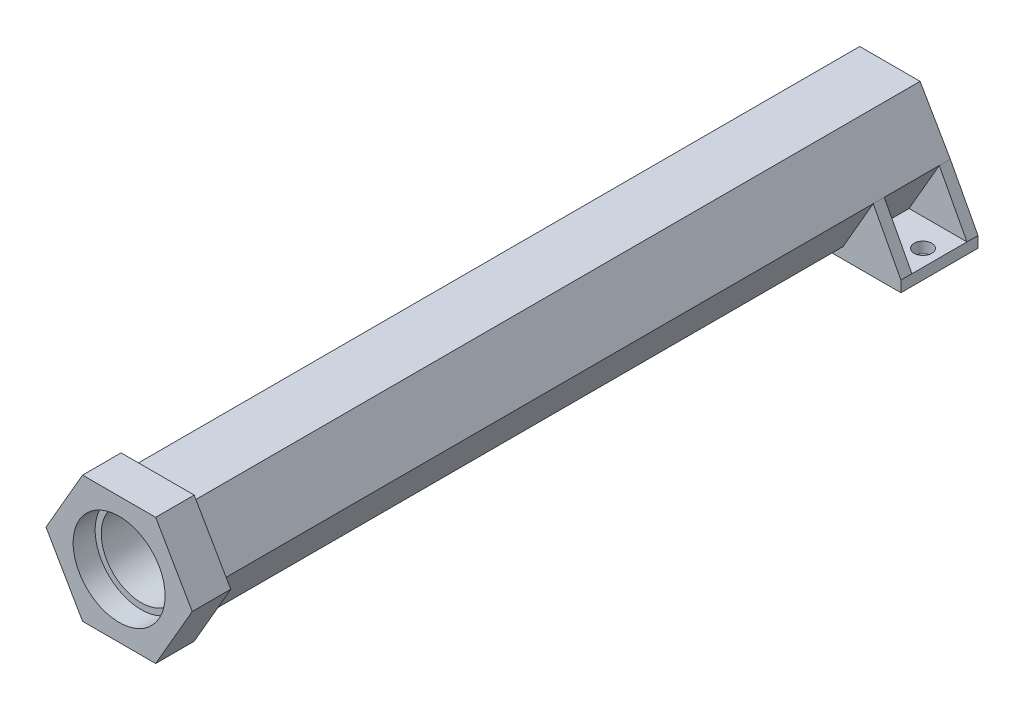
ISO-10303-21;
HEADER;
FILE_DESCRIPTION(('STEP AP214'),'2;1');
FILE_NAME('part.step','',(''),(''),'','','');
FILE_SCHEMA(('AUTOMOTIVE_DESIGN { 1 0 10303 214 1 1 1 1 }'));
ENDSEC;
DATA;
#1=APPLICATION_CONTEXT('core data for automotive mechanical design processes');
#2=APPLICATION_PROTOCOL_DEFINITION('international standard','automotive_design',2000,#1);
#3=PRODUCT_CONTEXT('',#1,'mechanical');
#4=PRODUCT('Part','Part','',(#3));
#5=PRODUCT_RELATED_PRODUCT_CATEGORY('part','',(#4));
#6=PRODUCT_DEFINITION_FORMATION('','',#4);
#7=PRODUCT_DEFINITION_CONTEXT('part definition',#1,'design');
#8=PRODUCT_DEFINITION('design','',#6,#7);
#9=PRODUCT_DEFINITION_SHAPE('','',#8);
#10=(LENGTH_UNIT() NAMED_UNIT(*) SI_UNIT(.MILLI.,.METRE.));
#11=(NAMED_UNIT(*) PLANE_ANGLE_UNIT() SI_UNIT($,.RADIAN.));
#12=(NAMED_UNIT(*) SI_UNIT($,.STERADIAN.) SOLID_ANGLE_UNIT());
#13=UNCERTAINTY_MEASURE_WITH_UNIT(LENGTH_MEASURE(1.E-05),#10,'distance_accuracy_value','');
#14=(GEOMETRIC_REPRESENTATION_CONTEXT(3) GLOBAL_UNCERTAINTY_ASSIGNED_CONTEXT((#13)) GLOBAL_UNIT_ASSIGNED_CONTEXT((#10,
#11,#12)) REPRESENTATION_CONTEXT('',''));
#15=CARTESIAN_POINT('',(0.,0.,0.));
#16=DIRECTION('',(0.,0.,1.));
#17=DIRECTION('',(1.,0.,0.));
#18=AXIS2_PLACEMENT_3D('',#15,#16,#17);
#19=CARTESIAN_POINT('',(-5.48482755730145,-9.5,136.));
#20=DIRECTION('',(0.,1.,0.));
#21=DIRECTION('',(0.,0.,1.));
#22=AXIS2_PLACEMENT_3D('',#19,#20,#21);
#23=PLANE('',#22);
#24=DIRECTION('',(-1.,0.,0.));
#25=VECTOR('',#24,1.);
#26=CARTESIAN_POINT('',(-16.,-9.5,14.));
#27=LINE('',#26,#25);
#28=CARTESIAN_POINT('',(5.48482755730144,-9.5,14.));
#29=VERTEX_POINT('',#28);
#30=CARTESIAN_POINT('',(-5.48482755730145,-9.5,14.));
#31=VERTEX_POINT('',#30);
#32=EDGE_CURVE('E215',#29,#31,#27,.T.);
#33=ORIENTED_EDGE('',*,*,#32,.F.);
#34=DIRECTION('',(0.,0.,-1.));
#35=VECTOR('',#34,1.);
#36=CARTESIAN_POINT('',(5.48482755730144,-9.5,136.));
#37=LINE('',#36,#35);
#38=CARTESIAN_POINT('',(5.48482755730144,-9.5,133.));
#39=VERTEX_POINT('',#38);
#40=EDGE_CURVE('E372',#39,#29,#37,.T.);
#41=ORIENTED_EDGE('',*,*,#40,.F.);
#42=DIRECTION('',(1.,0.,0.));
#43=VECTOR('',#42,1.);
#44=CARTESIAN_POINT('',(-5.48482755730145,-9.5,133.));
#45=LINE('',#44,#43);
#46=CARTESIAN_POINT('',(-5.48482755730145,-9.5,133.));
#47=VERTEX_POINT('',#46);
#48=EDGE_CURVE('E343',#47,#39,#45,.T.);
#49=ORIENTED_EDGE('',*,*,#48,.F.);
#50=DIRECTION('',(0.,0.,-1.));
#51=VECTOR('',#50,1.);
#52=CARTESIAN_POINT('',(-5.48482755730145,-9.5,136.));
#53=LINE('',#52,#51);
#54=EDGE_CURVE('E376',#47,#31,#53,.T.);
#55=ORIENTED_EDGE('',*,*,#54,.T.);
#56=EDGE_LOOP('',(#33,#41,#49,#55));
#57=FACE_BOUND('',#56,.T.);
#58=ADVANCED_FACE('F35',(#57),#23,.F.);
#59=CARTESIAN_POINT('',(-10.9696551146029,0.,136.));
#60=DIRECTION('',(0.866025403784439,0.5,0.));
#61=DIRECTION('',(-0.5,0.866025403784438,0.));
#62=AXIS2_PLACEMENT_3D('',#59,#60,#61);
#63=PLANE('',#62);
#64=DIRECTION('',(-0.5,0.866025403784438,0.));
#65=VECTOR('',#64,1.);
#66=CARTESIAN_POINT('',(-5.48482755730145,-9.5,14.));
#67=LINE('',#66,#65);
#68=CARTESIAN_POINT('',(-10.9696551146029,0.,14.));
#69=VERTEX_POINT('',#68);
#70=EDGE_CURVE('E50',#31,#69,#67,.T.);
#71=ORIENTED_EDGE('',*,*,#70,.F.);
#72=ORIENTED_EDGE('',*,*,#54,.F.);
#73=DIRECTION('',(0.5,-0.866025403784438,0.));
#74=VECTOR('',#73,1.);
#75=CARTESIAN_POINT('',(-10.9696551146029,0.,133.));
#76=LINE('',#75,#74);
#77=CARTESIAN_POINT('',(-10.9696551146029,0.,133.));
#78=VERTEX_POINT('',#77);
#79=EDGE_CURVE('E346',#78,#47,#76,.T.);
#80=ORIENTED_EDGE('',*,*,#79,.F.);
#81=DIRECTION('',(0.,0.,-1.));
#82=VECTOR('',#81,1.);
#83=CARTESIAN_POINT('',(-10.9696551146029,0.,136.));
#84=LINE('',#83,#82);
#85=EDGE_CURVE('E379',#78,#69,#84,.T.);
#86=ORIENTED_EDGE('',*,*,#85,.T.);
#87=EDGE_LOOP('',(#71,#72,#80,#86));
#88=FACE_BOUND('',#87,.T.);
#89=ADVANCED_FACE('F467',(#88),#63,.F.);
#90=CARTESIAN_POINT('',(5.48482755730144,-9.5,136.));
#91=DIRECTION('',(-0.866025403784439,0.5,0.));
#92=DIRECTION('',(-0.5,-0.866025403784439,0.));
#93=AXIS2_PLACEMENT_3D('',#90,#91,#92);
#94=PLANE('',#93);
#95=DIRECTION('',(-0.5,-0.866025403784439,0.));
#96=VECTOR('',#95,1.);
#97=CARTESIAN_POINT('',(10.9696551146029,0.,14.));
#98=LINE('',#97,#96);
#99=CARTESIAN_POINT('',(10.9696551146029,0.,14.));
#100=VERTEX_POINT('',#99);
#101=EDGE_CURVE('E246',#100,#29,#98,.T.);
#102=ORIENTED_EDGE('',*,*,#101,.F.);
#103=DIRECTION('',(0.,0.,-1.));
#104=VECTOR('',#103,1.);
#105=CARTESIAN_POINT('',(10.9696551146029,0.,136.));
#106=LINE('',#105,#104);
#107=CARTESIAN_POINT('',(10.9696551146029,0.,133.));
#108=VERTEX_POINT('',#107);
#109=EDGE_CURVE('E368',#108,#100,#106,.T.);
#110=ORIENTED_EDGE('',*,*,#109,.F.);
#111=DIRECTION('',(0.5,0.866025403784439,0.));
#112=VECTOR('',#111,1.);
#113=CARTESIAN_POINT('',(5.48482755730144,-9.5,133.));
#114=LINE('',#113,#112);
#115=EDGE_CURVE('E340',#39,#108,#114,.T.);
#116=ORIENTED_EDGE('',*,*,#115,.F.);
#117=ORIENTED_EDGE('',*,*,#40,.T.);
#118=EDGE_LOOP('',(#102,#110,#116,#117));
#119=FACE_BOUND('',#118,.T.);
#120=ADVANCED_FACE('F473',(#119),#94,.F.);
#121=CARTESIAN_POINT('',(-5.48482755730145,-9.5,12.));
#122=VERTEX_POINT('',#121);
#123=CARTESIAN_POINT('',(-5.48482755730145,-9.5,2.));
#124=VERTEX_POINT('',#123);
#125=EDGE_CURVE('E375',#122,#124,#53,.T.);
#126=ORIENTED_EDGE('',*,*,#125,.F.);
#127=DIRECTION('',(-0.5,0.866025403784438,0.));
#128=VECTOR('',#127,1.);
#129=CARTESIAN_POINT('',(-5.48482755730145,-9.5,12.));
#130=LINE('',#129,#128);
#131=CARTESIAN_POINT('',(-10.9696551146029,0.,12.));
#132=VERTEX_POINT('',#131);
#133=EDGE_CURVE('E226',#122,#132,#130,.T.);
#134=ORIENTED_EDGE('',*,*,#133,.T.);
#135=CARTESIAN_POINT('',(-10.9696551146029,0.,2.));
#136=VERTEX_POINT('',#135);
#137=EDGE_CURVE('E378',#132,#136,#84,.T.);
#138=ORIENTED_EDGE('',*,*,#137,.T.);
#139=DIRECTION('',(-0.5,0.866025403784438,0.));
#140=VECTOR('',#139,1.);
#141=CARTESIAN_POINT('',(-5.48482755730145,-9.5,2.));
#142=LINE('',#141,#140);
#143=EDGE_CURVE('E265',#124,#136,#142,.T.);
#144=ORIENTED_EDGE('',*,*,#143,.F.);
#145=EDGE_LOOP('',(#126,#134,#138,#144));
#146=FACE_BOUND('',#145,.T.);
#147=ADVANCED_FACE('F406',(#146),#63,.F.);
#148=CARTESIAN_POINT('',(10.9696551146029,0.,12.));
#149=VERTEX_POINT('',#148);
#150=CARTESIAN_POINT('',(10.9696551146029,0.,2.));
#151=VERTEX_POINT('',#150);
#152=EDGE_CURVE('E367',#149,#151,#106,.T.);
#153=ORIENTED_EDGE('',*,*,#152,.F.);
#154=DIRECTION('',(-0.5,-0.866025403784439,0.));
#155=VECTOR('',#154,1.);
#156=CARTESIAN_POINT('',(10.9696551146029,0.,12.));
#157=LINE('',#156,#155);
#158=CARTESIAN_POINT('',(5.48482755730144,-9.5,12.));
#159=VERTEX_POINT('',#158);
#160=EDGE_CURVE('E253',#149,#159,#157,.T.);
#161=ORIENTED_EDGE('',*,*,#160,.T.);
#162=CARTESIAN_POINT('',(5.48482755730144,-9.5,2.));
#163=VERTEX_POINT('',#162);
#164=EDGE_CURVE('E371',#159,#163,#37,.T.);
#165=ORIENTED_EDGE('',*,*,#164,.T.);
#166=DIRECTION('',(-0.5,-0.866025403784439,0.));
#167=VECTOR('',#166,1.);
#168=CARTESIAN_POINT('',(10.9696551146029,0.,2.));
#169=LINE('',#168,#167);
#170=EDGE_CURVE('E279',#151,#163,#169,.T.);
#171=ORIENTED_EDGE('',*,*,#170,.F.);
#172=EDGE_LOOP('',(#153,#161,#165,#171));
#173=FACE_BOUND('',#172,.T.);
#174=ADVANCED_FACE('F475',(#173),#94,.F.);
#175=CARTESIAN_POINT('',(0.,0.,136.));
#176=DIRECTION('',(0.,0.,1.));
#177=DIRECTION('',(1.,0.,0.));
#178=AXIS2_PLACEMENT_3D('',#175,#176,#177);
#179=PLANE('',#178);
#180=CARTESIAN_POINT('',(0.,0.,136.));
#181=DIRECTION('',(0.,0.,1.));
#182=DIRECTION('',(1.,0.,0.));
#183=AXIS2_PLACEMENT_3D('',#180,#181,#182);
#184=CIRCLE('',#183,8.35);
#185=CARTESIAN_POINT('',(8.35,0.,136.));
#186=VERTEX_POINT('',#185);
#187=EDGE_CURVE('E11',#186,#186,#184,.F.);
#188=ORIENTED_EDGE('',*,*,#187,.F.);
#189=EDGE_LOOP('',(#188));
#190=FACE_BOUND('',#189,.T.);
#191=CARTESIAN_POINT('',(0.,0.,136.));
#192=DIRECTION('',(0.,0.,1.));
#193=DIRECTION('',(1.,0.,0.));
#194=AXIS2_PLACEMENT_3D('',#191,#192,#193);
#195=CIRCLE('',#194,7.25);
#196=CARTESIAN_POINT('',(7.25,0.,136.));
#197=VERTEX_POINT('',#196);
#198=EDGE_CURVE('E352',#197,#197,#195,.T.);
#199=ORIENTED_EDGE('',*,*,#198,.F.);
#200=EDGE_LOOP('',(#199));
#201=FACE_BOUND('',#200,.T.);
#202=ADVANCED_FACE('F482',(#190,#201),#179,.T.);
#203=CARTESIAN_POINT('',(0.,0.,136.));
#204=DIRECTION('',(0.,0.,-1.));
#205=DIRECTION('',(-1.,0.,0.));
#206=AXIS2_PLACEMENT_3D('',#203,#204,#205);
#207=CYLINDRICAL_SURFACE('',#206,7.25);
#208=CARTESIAN_POINT('',(0.,0.,2.));
#209=DIRECTION('',(0.,0.,1.));
#210=DIRECTION('',(1.,0.,0.));
#211=AXIS2_PLACEMENT_3D('',#208,#209,#210);
#212=CIRCLE('',#211,7.25);
#213=CARTESIAN_POINT('',(7.25,0.,2.));
#214=VERTEX_POINT('',#213);
#215=EDGE_CURVE('E381',#214,#214,#212,.T.);
#216=ORIENTED_EDGE('',*,*,#215,.F.);
#217=EDGE_LOOP('',(#216));
#218=FACE_BOUND('',#217,.T.);
#219=ORIENTED_EDGE('',*,*,#198,.T.);
#220=EDGE_LOOP('',(#219));
#221=FACE_BOUND('',#220,.T.);
#222=ADVANCED_FACE('F556',(#218,#221),#207,.F.);
#223=CARTESIAN_POINT('',(0.,0.,2.));
#224=DIRECTION('',(0.,0.,1.));
#225=DIRECTION('',(1.,0.,0.));
#226=AXIS2_PLACEMENT_3D('',#223,#224,#225);
#227=PLANE('',#226);
#228=CARTESIAN_POINT('',(0.,0.,2.));
#229=DIRECTION('',(0.,0.,1.));
#230=DIRECTION('',(1.,0.,0.));
#231=AXIS2_PLACEMENT_3D('',#228,#229,#230);
#232=CIRCLE('',#231,2.6);
#233=CARTESIAN_POINT('',(2.6,0.,2.));
#234=VERTEX_POINT('',#233);
#235=EDGE_CURVE('E442',#234,#234,#232,.F.);
#236=ORIENTED_EDGE('',*,*,#235,.T.);
#237=EDGE_LOOP('',(#236));
#238=FACE_BOUND('',#237,.T.);
#239=ORIENTED_EDGE('',*,*,#215,.T.);
#240=EDGE_LOOP('',(#239));
#241=FACE_BOUND('',#240,.T.);
#242=ADVANCED_FACE('F530',(#238,#241),#227,.T.);
#243=CARTESIAN_POINT('',(0.,0.,133.));
#244=DIRECTION('',(0.,0.,1.));
#245=DIRECTION('',(1.,0.,0.));
#246=AXIS2_PLACEMENT_3D('',#243,#244,#245);
#247=PLANE('',#246);
#248=DIRECTION('',(0.5,0.866025403784439,0.));
#249=VECTOR('',#248,1.);
#250=CARTESIAN_POINT('',(6.63952809568069,-11.5,133.));
#251=LINE('',#250,#249);
#252=CARTESIAN_POINT('',(6.63952809568069,-11.5,133.));
#253=VERTEX_POINT('',#252);
#254=CARTESIAN_POINT('',(13.2790561913614,0.,133.));
#255=VERTEX_POINT('',#254);
#256=EDGE_CURVE('E293',#253,#255,#251,.T.);
#257=ORIENTED_EDGE('',*,*,#256,.F.);
#258=DIRECTION('',(1.,0.,0.));
#259=VECTOR('',#258,1.);
#260=CARTESIAN_POINT('',(-6.6395280956807,-11.5,133.));
#261=LINE('',#260,#259);
#262=CARTESIAN_POINT('',(-6.6395280956807,-11.5,133.));
#263=VERTEX_POINT('',#262);
#264=EDGE_CURVE('E298',#263,#253,#261,.T.);
#265=ORIENTED_EDGE('',*,*,#264,.F.);
#266=DIRECTION('',(0.5,-0.866025403784439,0.));
#267=VECTOR('',#266,1.);
#268=CARTESIAN_POINT('',(-13.2790561913614,0.,133.));
#269=LINE('',#268,#267);
#270=CARTESIAN_POINT('',(-13.2790561913614,0.,133.));
#271=VERTEX_POINT('',#270);
#272=EDGE_CURVE('E317',#271,#263,#269,.T.);
#273=ORIENTED_EDGE('',*,*,#272,.F.);
#274=DIRECTION('',(-0.5,-0.866025403784438,0.));
#275=VECTOR('',#274,1.);
#276=CARTESIAN_POINT('',(-6.6395280956807,11.5,133.));
#277=LINE('',#276,#275);
#278=CARTESIAN_POINT('',(-6.6395280956807,11.5,133.));
#279=VERTEX_POINT('',#278);
#280=EDGE_CURVE('E315',#279,#271,#277,.T.);
#281=ORIENTED_EDGE('',*,*,#280,.F.);
#282=DIRECTION('',(-1.,0.,0.));
#283=VECTOR('',#282,1.);
#284=CARTESIAN_POINT('',(6.63952809568069,11.5,133.));
#285=LINE('',#284,#283);
#286=CARTESIAN_POINT('',(6.63952809568069,11.5,133.));
#287=VERTEX_POINT('',#286);
#288=EDGE_CURVE('E313',#287,#279,#285,.T.);
#289=ORIENTED_EDGE('',*,*,#288,.F.);
#290=DIRECTION('',(-0.5,0.866025403784439,0.));
#291=VECTOR('',#290,1.);
#292=CARTESIAN_POINT('',(13.2790561913614,0.,133.));
#293=LINE('',#292,#291);
#294=EDGE_CURVE('E311',#255,#287,#293,.T.);
#295=ORIENTED_EDGE('',*,*,#294,.F.);
#296=EDGE_LOOP('',(#257,#265,#273,#281,#289,#295));
#297=FACE_BOUND('',#296,.T.);
#298=DIRECTION('',(-1.,0.,0.));
#299=VECTOR('',#298,1.);
#300=CARTESIAN_POINT('',(5.48482755730143,9.5,133.));
#301=LINE('',#300,#299);
#302=CARTESIAN_POINT('',(5.48482755730143,9.5,133.));
#303=VERTEX_POINT('',#302);
#304=CARTESIAN_POINT('',(-5.48482755730145,9.5,133.));
#305=VERTEX_POINT('',#304);
#306=EDGE_CURVE('E43',#303,#305,#301,.T.);
#307=ORIENTED_EDGE('',*,*,#306,.T.);
#308=DIRECTION('',(-0.499999999999999,-0.866025403784439,0.));
#309=VECTOR('',#308,1.);
#310=CARTESIAN_POINT('',(-5.48482755730145,9.5,133.));
#311=LINE('',#310,#309);
#312=EDGE_CURVE('E349',#305,#78,#311,.T.);
#313=ORIENTED_EDGE('',*,*,#312,.T.);
#314=ORIENTED_EDGE('',*,*,#79,.T.);
#315=ORIENTED_EDGE('',*,*,#48,.T.);
#316=ORIENTED_EDGE('',*,*,#115,.T.);
#317=DIRECTION('',(-0.5,0.866025403784439,0.));
#318=VECTOR('',#317,1.);
#319=CARTESIAN_POINT('',(10.9696551146029,0.,133.));
#320=LINE('',#319,#318);
#321=EDGE_CURVE('E337',#108,#303,#320,.T.);
#322=ORIENTED_EDGE('',*,*,#321,.T.);
#323=EDGE_LOOP('',(#307,#313,#314,#315,#316,#322));
#324=FACE_BOUND('',#323,.T.);
#325=ADVANCED_FACE('F385',(#297,#324),#247,.F.);
#326=CARTESIAN_POINT('',(0.,0.,140.));
#327=DIRECTION('',(0.,0.,1.));
#328=DIRECTION('',(1.,0.,0.));
#329=AXIS2_PLACEMENT_3D('',#326,#327,#328);
#330=PLANE('',#329);
#331=DIRECTION('',(0.5,0.866025403784439,0.));
#332=VECTOR('',#331,1.);
#333=CARTESIAN_POINT('',(6.63952809568069,-11.5,140.));
#334=LINE('',#333,#332);
#335=CARTESIAN_POINT('',(6.63952809568069,-11.5,140.));
#336=VERTEX_POINT('',#335);
#337=CARTESIAN_POINT('',(13.2790561913614,0.,140.));
#338=VERTEX_POINT('',#337);
#339=EDGE_CURVE('E294',#336,#338,#334,.T.);
#340=ORIENTED_EDGE('',*,*,#339,.T.);
#341=DIRECTION('',(-0.5,0.866025403784439,0.));
#342=VECTOR('',#341,1.);
#343=CARTESIAN_POINT('',(13.2790561913614,0.,140.));
#344=LINE('',#343,#342);
#345=CARTESIAN_POINT('',(6.63952809568069,11.5,140.));
#346=VERTEX_POINT('',#345);
#347=EDGE_CURVE('E297',#338,#346,#344,.T.);
#348=ORIENTED_EDGE('',*,*,#347,.T.);
#349=DIRECTION('',(-1.,0.,0.));
#350=VECTOR('',#349,1.);
#351=CARTESIAN_POINT('',(6.63952809568069,11.5,140.));
#352=LINE('',#351,#350);
#353=CARTESIAN_POINT('',(-6.6395280956807,11.5,140.));
#354=VERTEX_POINT('',#353);
#355=EDGE_CURVE('E300',#346,#354,#352,.T.);
#356=ORIENTED_EDGE('',*,*,#355,.T.);
#357=DIRECTION('',(-0.5,-0.866025403784438,0.));
#358=VECTOR('',#357,1.);
#359=CARTESIAN_POINT('',(-6.6395280956807,11.5,140.));
#360=LINE('',#359,#358);
#361=CARTESIAN_POINT('',(-13.2790561913614,0.,140.));
#362=VERTEX_POINT('',#361);
#363=EDGE_CURVE('E302',#354,#362,#360,.T.);
#364=ORIENTED_EDGE('',*,*,#363,.T.);
#365=DIRECTION('',(0.5,-0.866025403784439,0.));
#366=VECTOR('',#365,1.);
#367=CARTESIAN_POINT('',(-13.2790561913614,0.,140.));
#368=LINE('',#367,#366);
#369=CARTESIAN_POINT('',(-6.6395280956807,-11.5,140.));
#370=VERTEX_POINT('',#369);
#371=EDGE_CURVE('E304',#362,#370,#368,.T.);
#372=ORIENTED_EDGE('',*,*,#371,.T.);
#373=DIRECTION('',(1.,0.,0.));
#374=VECTOR('',#373,1.);
#375=CARTESIAN_POINT('',(-6.6395280956807,-11.5,140.));
#376=LINE('',#375,#374);
#377=EDGE_CURVE('E306',#370,#336,#376,.T.);
#378=ORIENTED_EDGE('',*,*,#377,.T.);
#379=EDGE_LOOP('',(#340,#348,#356,#364,#372,#378));
#380=FACE_BOUND('',#379,.T.);
#381=CARTESIAN_POINT('',(0.,0.,140.));
#382=DIRECTION('',(0.,0.,1.));
#383=DIRECTION('',(1.,0.,0.));
#384=AXIS2_PLACEMENT_3D('',#381,#382,#383);
#385=CIRCLE('',#384,8.35);
#386=CARTESIAN_POINT('',(8.35,0.,140.));
#387=VERTEX_POINT('',#386);
#388=EDGE_CURVE('E290',#387,#387,#385,.T.);
#389=ORIENTED_EDGE('',*,*,#388,.F.);
#390=EDGE_LOOP('',(#389));
#391=FACE_BOUND('',#390,.T.);
#392=ADVANCED_FACE('F523',(#380,#391),#330,.T.);
#393=CARTESIAN_POINT('',(6.63952809568069,-11.5,140.));
#394=DIRECTION('',(-0.866025403784439,0.5,0.));
#395=DIRECTION('',(-0.5,-0.866025403784439,0.));
#396=AXIS2_PLACEMENT_3D('',#393,#394,#395);
#397=PLANE('',#396);
#398=ORIENTED_EDGE('',*,*,#256,.T.);
#399=DIRECTION('',(0.,0.,-1.));
#400=VECTOR('',#399,1.);
#401=CARTESIAN_POINT('',(13.2790561913614,0.,140.));
#402=LINE('',#401,#400);
#403=EDGE_CURVE('E334',#338,#255,#402,.T.);
#404=ORIENTED_EDGE('',*,*,#403,.F.);
#405=ORIENTED_EDGE('',*,*,#339,.F.);
#406=DIRECTION('',(0.,0.,-1.));
#407=VECTOR('',#406,1.);
#408=CARTESIAN_POINT('',(6.63952809568069,-11.5,140.));
#409=LINE('',#408,#407);
#410=EDGE_CURVE('E308',#336,#253,#409,.T.);
#411=ORIENTED_EDGE('',*,*,#410,.T.);
#412=EDGE_LOOP('',(#398,#404,#405,#411));
#413=FACE_BOUND('',#412,.T.);
#414=ADVANCED_FACE('F526',(#413),#397,.F.);
#415=CARTESIAN_POINT('',(13.2790561913614,0.,140.));
#416=DIRECTION('',(-0.866025403784439,-0.5,0.));
#417=DIRECTION('',(0.5,-0.866025403784439,0.));
#418=AXIS2_PLACEMENT_3D('',#415,#416,#417);
#419=PLANE('',#418);
#420=ORIENTED_EDGE('',*,*,#294,.T.);
#421=DIRECTION('',(0.,0.,-1.));
#422=VECTOR('',#421,1.);
#423=CARTESIAN_POINT('',(6.63952809568069,11.5,140.));
#424=LINE('',#423,#422);
#425=EDGE_CURVE('E331',#346,#287,#424,.T.);
#426=ORIENTED_EDGE('',*,*,#425,.F.);
#427=ORIENTED_EDGE('',*,*,#347,.F.);
#428=ORIENTED_EDGE('',*,*,#403,.T.);
#429=EDGE_LOOP('',(#420,#426,#427,#428));
#430=FACE_BOUND('',#429,.T.);
#431=ADVANCED_FACE('F546',(#430),#419,.F.);
#432=CARTESIAN_POINT('',(6.63952809568069,11.5,140.));
#433=DIRECTION('',(0.,-1.,0.));
#434=DIRECTION('',(1.,0.,0.));
#435=AXIS2_PLACEMENT_3D('',#432,#433,#434);
#436=PLANE('',#435);
#437=ORIENTED_EDGE('',*,*,#288,.T.);
#438=DIRECTION('',(0.,0.,-1.));
#439=VECTOR('',#438,1.);
#440=CARTESIAN_POINT('',(-6.6395280956807,11.5,140.));
#441=LINE('',#440,#439);
#442=EDGE_CURVE('E328',#354,#279,#441,.T.);
#443=ORIENTED_EDGE('',*,*,#442,.F.);
#444=ORIENTED_EDGE('',*,*,#355,.F.);
#445=ORIENTED_EDGE('',*,*,#425,.T.);
#446=EDGE_LOOP('',(#437,#443,#444,#445));
#447=FACE_BOUND('',#446,.T.);
#448=ADVANCED_FACE('F542',(#447),#436,.F.);
#449=CARTESIAN_POINT('',(-6.6395280956807,11.5,140.));
#450=DIRECTION('',(0.866025403784439,-0.5,0.));
#451=DIRECTION('',(0.5,0.866025403784439,0.));
#452=AXIS2_PLACEMENT_3D('',#449,#450,#451);
#453=PLANE('',#452);
#454=ORIENTED_EDGE('',*,*,#280,.T.);
#455=DIRECTION('',(0.,0.,-1.));
#456=VECTOR('',#455,1.);
#457=CARTESIAN_POINT('',(-13.2790561913614,0.,140.));
#458=LINE('',#457,#456);
#459=EDGE_CURVE('E325',#362,#271,#458,.T.);
#460=ORIENTED_EDGE('',*,*,#459,.F.);
#461=ORIENTED_EDGE('',*,*,#363,.F.);
#462=ORIENTED_EDGE('',*,*,#442,.T.);
#463=EDGE_LOOP('',(#454,#460,#461,#462));
#464=FACE_BOUND('',#463,.T.);
#465=ADVANCED_FACE('F538',(#464),#453,.F.);
#466=CARTESIAN_POINT('',(-13.2790561913614,0.,140.));
#467=DIRECTION('',(0.866025403784439,0.5,0.));
#468=DIRECTION('',(-0.5,0.866025403784439,0.));
#469=AXIS2_PLACEMENT_3D('',#466,#467,#468);
#470=PLANE('',#469);
#471=ORIENTED_EDGE('',*,*,#272,.T.);
#472=DIRECTION('',(0.,0.,-1.));
#473=VECTOR('',#472,1.);
#474=CARTESIAN_POINT('',(-6.6395280956807,-11.5,140.));
#475=LINE('',#474,#473);
#476=EDGE_CURVE('E322',#370,#263,#475,.T.);
#477=ORIENTED_EDGE('',*,*,#476,.F.);
#478=ORIENTED_EDGE('',*,*,#371,.F.);
#479=ORIENTED_EDGE('',*,*,#459,.T.);
#480=EDGE_LOOP('',(#471,#477,#478,#479));
#481=FACE_BOUND('',#480,.T.);
#482=ADVANCED_FACE('F534',(#481),#470,.F.);
#483=CARTESIAN_POINT('',(-6.6395280956807,-11.5,140.));
#484=DIRECTION('',(0.,1.,0.));
#485=DIRECTION('',(0.,0.,1.));
#486=AXIS2_PLACEMENT_3D('',#483,#484,#485);
#487=PLANE('',#486);
#488=ORIENTED_EDGE('',*,*,#264,.T.);
#489=ORIENTED_EDGE('',*,*,#410,.F.);
#490=ORIENTED_EDGE('',*,*,#377,.F.);
#491=ORIENTED_EDGE('',*,*,#476,.T.);
#492=EDGE_LOOP('',(#488,#489,#490,#491));
#493=FACE_BOUND('',#492,.T.);
#494=ADVANCED_FACE('F462',(#493),#487,.F.);
#495=CARTESIAN_POINT('',(0.,0.,140.));
#496=DIRECTION('',(0.,0.,-1.));
#497=DIRECTION('',(-1.,0.,0.));
#498=AXIS2_PLACEMENT_3D('',#495,#496,#497);
#499=CYLINDRICAL_SURFACE('',#498,8.35);
#500=ORIENTED_EDGE('',*,*,#187,.T.);
#501=EDGE_LOOP('',(#500));
#502=FACE_BOUND('',#501,.T.);
#503=ORIENTED_EDGE('',*,*,#388,.T.);
#504=EDGE_LOOP('',(#503));
#505=FACE_BOUND('',#504,.T.);
#506=ADVANCED_FACE('F455',(#502,#505),#499,.F.);
#507=CARTESIAN_POINT('',(0.,0.,0.));
#508=DIRECTION('',(0.,0.,1.));
#509=DIRECTION('',(1.,0.,0.));
#510=AXIS2_PLACEMENT_3D('',#507,#508,#509);
#511=PLANE('',#510);
#512=CARTESIAN_POINT('',(0.,0.,0.));
#513=DIRECTION('',(0.,0.,-1.));
#514=DIRECTION('',(-1.,0.,0.));
#515=AXIS2_PLACEMENT_3D('',#512,#513,#514);
#516=CIRCLE('',#515,2.6);
#517=CARTESIAN_POINT('',(-2.6,0.,0.));
#518=VERTEX_POINT('',#517);
#519=EDGE_CURVE('E447',#518,#518,#516,.T.);
#520=ORIENTED_EDGE('',*,*,#519,.F.);
#521=EDGE_LOOP('',(#520));
#522=FACE_BOUND('',#521,.T.);
#523=DIRECTION('',(-0.499999999999999,-0.866025403784439,0.));
#524=VECTOR('',#523,1.);
#525=CARTESIAN_POINT('',(-5.48482755730145,9.5,0.));
#526=LINE('',#525,#524);
#527=CARTESIAN_POINT('',(-5.48482755730145,9.5,0.));
#528=VERTEX_POINT('',#527);
#529=CARTESIAN_POINT('',(-10.9696551146029,0.,0.));
#530=VERTEX_POINT('',#529);
#531=EDGE_CURVE('E355',#528,#530,#526,.T.);
#532=ORIENTED_EDGE('',*,*,#531,.F.);
#533=DIRECTION('',(-1.,0.,0.));
#534=VECTOR('',#533,1.);
#535=CARTESIAN_POINT('',(5.48482755730143,9.5,0.));
#536=LINE('',#535,#534);
#537=CARTESIAN_POINT('',(5.48482755730143,9.5,0.));
#538=VERTEX_POINT('',#537);
#539=EDGE_CURVE('E360',#538,#528,#536,.T.);
#540=ORIENTED_EDGE('',*,*,#539,.F.);
#541=DIRECTION('',(-0.5,0.866025403784439,0.));
#542=VECTOR('',#541,1.);
#543=CARTESIAN_POINT('',(10.9696551146029,0.,0.));
#544=LINE('',#543,#542);
#545=CARTESIAN_POINT('',(10.9696551146029,0.,0.));
#546=VERTEX_POINT('',#545);
#547=EDGE_CURVE('E357',#546,#538,#544,.T.);
#548=ORIENTED_EDGE('',*,*,#547,.F.);
#549=DIRECTION('',(-0.467955520768503,0.883752018714684,0.));
#550=VECTOR('',#549,1.);
#551=CARTESIAN_POINT('',(16.,-9.5,0.));
#552=LINE('',#551,#550);
#553=CARTESIAN_POINT('',(16.,-9.5,0.));
#554=VERTEX_POINT('',#553);
#555=EDGE_CURVE('E275',#554,#546,#552,.T.);
#556=ORIENTED_EDGE('',*,*,#555,.F.);
#557=DIRECTION('',(0.,1.,0.));
#558=VECTOR('',#557,1.);
#559=CARTESIAN_POINT('',(16.,-11.5,0.));
#560=LINE('',#559,#558);
#561=CARTESIAN_POINT('',(16.,-11.5,0.));
#562=VERTEX_POINT('',#561);
#563=EDGE_CURVE('E201',#562,#554,#560,.T.);
#564=ORIENTED_EDGE('',*,*,#563,.F.);
#565=DIRECTION('',(1.,0.,0.));
#566=VECTOR('',#565,1.);
#567=CARTESIAN_POINT('',(-16.,-11.5,0.));
#568=LINE('',#567,#566);
#569=CARTESIAN_POINT('',(-16.,-11.5,0.));
#570=VERTEX_POINT('',#569);
#571=EDGE_CURVE('E192',#570,#562,#568,.T.);
#572=ORIENTED_EDGE('',*,*,#571,.F.);
#573=DIRECTION('',(0.,1.,0.));
#574=VECTOR('',#573,1.);
#575=CARTESIAN_POINT('',(-16.,-11.5,0.));
#576=LINE('',#575,#574);
#577=CARTESIAN_POINT('',(-16.,-9.5,0.));
#578=VERTEX_POINT('',#577);
#579=EDGE_CURVE('E198',#570,#578,#576,.T.);
#580=ORIENTED_EDGE('',*,*,#579,.T.);
#581=DIRECTION('',(-0.467955520768505,-0.883752018714683,0.));
#582=VECTOR('',#581,1.);
#583=CARTESIAN_POINT('',(-10.9696551146029,0.,0.));
#584=LINE('',#583,#582);
#585=EDGE_CURVE('E261',#530,#578,#584,.T.);
#586=ORIENTED_EDGE('',*,*,#585,.F.);
#587=EDGE_LOOP('',(#532,#540,#548,#556,#564,#572,#580,#586));
#588=FACE_BOUND('',#587,.T.);
#589=ADVANCED_FACE('F195',(#522,#588),#511,.F.);
#590=CARTESIAN_POINT('',(5.48482755730143,9.5,136.));
#591=DIRECTION('',(0.,-1.,0.));
#592=DIRECTION('',(1.,0.,0.));
#593=AXIS2_PLACEMENT_3D('',#590,#591,#592);
#594=PLANE('',#593);
#595=ORIENTED_EDGE('',*,*,#306,.F.);
#596=DIRECTION('',(0.,0.,-1.));
#597=VECTOR('',#596,1.);
#598=CARTESIAN_POINT('',(5.48482755730143,9.5,136.));
#599=LINE('',#598,#597);
#600=EDGE_CURVE('E365',#303,#538,#599,.T.);
#601=ORIENTED_EDGE('',*,*,#600,.T.);
#602=ORIENTED_EDGE('',*,*,#539,.T.);
#603=DIRECTION('',(0.,0.,-1.));
#604=VECTOR('',#603,1.);
#605=CARTESIAN_POINT('',(-5.48482755730145,9.5,136.));
#606=LINE('',#605,#604);
#607=EDGE_CURVE('E363',#305,#528,#606,.T.);
#608=ORIENTED_EDGE('',*,*,#607,.F.);
#609=EDGE_LOOP('',(#595,#601,#602,#608));
#610=FACE_BOUND('',#609,.T.);
#611=ADVANCED_FACE('F389',(#610),#594,.F.);
#612=CARTESIAN_POINT('',(10.9696551146029,0.,136.));
#613=DIRECTION('',(-0.866025403784439,-0.5,0.));
#614=DIRECTION('',(0.5,-0.866025403784439,0.));
#615=AXIS2_PLACEMENT_3D('',#612,#613,#614);
#616=PLANE('',#615);
#617=ORIENTED_EDGE('',*,*,#321,.F.);
#618=ORIENTED_EDGE('',*,*,#109,.T.);
#619=DIRECTION('',(0.,0.,-1.));
#620=VECTOR('',#619,1.);
#621=CARTESIAN_POINT('',(10.9696551146029,0.,14.));
#622=LINE('',#621,#620);
#623=EDGE_CURVE('E258',#100,#149,#622,.T.);
#624=ORIENTED_EDGE('',*,*,#623,.T.);
#625=ORIENTED_EDGE('',*,*,#152,.T.);
#626=DIRECTION('',(0.,0.,-1.));
#627=VECTOR('',#626,1.);
#628=CARTESIAN_POINT('',(10.9696551146029,0.,2.));
#629=LINE('',#628,#627);
#630=EDGE_CURVE('E288',#151,#546,#629,.T.);
#631=ORIENTED_EDGE('',*,*,#630,.T.);
#632=ORIENTED_EDGE('',*,*,#547,.T.);
#633=ORIENTED_EDGE('',*,*,#600,.F.);
#634=EDGE_LOOP('',(#617,#618,#624,#625,#631,#632,#633));
#635=FACE_BOUND('',#634,.T.);
#636=ADVANCED_FACE('F391',(#635),#616,.F.);
#637=CARTESIAN_POINT('',(-5.48482755730145,9.5,136.));
#638=DIRECTION('',(0.866025403784439,-0.499999999999999,0.));
#639=DIRECTION('',(0.499999999999999,0.866025403784439,0.));
#640=AXIS2_PLACEMENT_3D('',#637,#638,#639);
#641=PLANE('',#640);
#642=ORIENTED_EDGE('',*,*,#312,.F.);
#643=ORIENTED_EDGE('',*,*,#607,.T.);
#644=ORIENTED_EDGE('',*,*,#531,.T.);
#645=DIRECTION('',(0.,0.,-1.));
#646=VECTOR('',#645,1.);
#647=CARTESIAN_POINT('',(-10.9696551146029,0.,2.));
#648=LINE('',#647,#646);
#649=EDGE_CURVE('E272',#136,#530,#648,.T.);
#650=ORIENTED_EDGE('',*,*,#649,.F.);
#651=ORIENTED_EDGE('',*,*,#137,.F.);
#652=DIRECTION('',(0.,0.,-1.));
#653=VECTOR('',#652,1.);
#654=CARTESIAN_POINT('',(-10.9696551146029,0.,14.));
#655=LINE('',#654,#653);
#656=EDGE_CURVE('E58',#69,#132,#655,.T.);
#657=ORIENTED_EDGE('',*,*,#656,.F.);
#658=ORIENTED_EDGE('',*,*,#85,.F.);
#659=EDGE_LOOP('',(#642,#643,#644,#650,#651,#657,#658));
#660=FACE_BOUND('',#659,.T.);
#661=ADVANCED_FACE('F37',(#660),#641,.F.);
#662=CARTESIAN_POINT('',(16.,-9.5,2.));
#663=DIRECTION('',(-0.883752018714684,-0.467955520768503,0.));
#664=DIRECTION('',(0.467955520768503,-0.883752018714684,0.));
#665=AXIS2_PLACEMENT_3D('',#662,#663,#664);
#666=PLANE('',#665);
#667=ORIENTED_EDGE('',*,*,#555,.T.);
#668=ORIENTED_EDGE('',*,*,#630,.F.);
#669=DIRECTION('',(-0.467955520768503,0.883752018714684,0.));
#670=VECTOR('',#669,1.);
#671=CARTESIAN_POINT('',(16.,-9.5,2.));
#672=LINE('',#671,#670);
#673=CARTESIAN_POINT('',(16.,-9.5,2.));
#674=VERTEX_POINT('',#673);
#675=EDGE_CURVE('E276',#674,#151,#672,.T.);
#676=ORIENTED_EDGE('',*,*,#675,.F.);
#677=DIRECTION('',(0.,0.,-1.));
#678=VECTOR('',#677,1.);
#679=CARTESIAN_POINT('',(16.,-9.5,2.));
#680=LINE('',#679,#678);
#681=EDGE_CURVE('E284',#674,#554,#680,.T.);
#682=ORIENTED_EDGE('',*,*,#681,.T.);
#683=EDGE_LOOP('',(#667,#668,#676,#682));
#684=FACE_BOUND('',#683,.T.);
#685=ADVANCED_FACE('F509',(#684),#666,.F.);
#686=CARTESIAN_POINT('',(0.,0.,2.));
#687=DIRECTION('',(0.,0.,-1.));
#688=DIRECTION('',(-1.,0.,0.));
#689=AXIS2_PLACEMENT_3D('',#686,#687,#688);
#690=PLANE('',#689);
#691=ORIENTED_EDGE('',*,*,#675,.T.);
#692=ORIENTED_EDGE('',*,*,#170,.T.);
#693=DIRECTION('',(1.,0.,0.));
#694=VECTOR('',#693,1.);
#695=CARTESIAN_POINT('',(5.48482755730144,-9.5,2.));
#696=LINE('',#695,#694);
#697=EDGE_CURVE('E282',#163,#674,#696,.T.);
#698=ORIENTED_EDGE('',*,*,#697,.T.);
#699=EDGE_LOOP('',(#691,#692,#698));
#700=FACE_BOUND('',#699,.T.);
#701=ADVANCED_FACE('F511',(#700),#690,.F.);
#702=CARTESIAN_POINT('',(-10.9696551146029,0.,2.));
#703=DIRECTION('',(0.883752018714683,-0.467955520768505,0.));
#704=DIRECTION('',(0.467955520768505,0.883752018714683,0.));
#705=AXIS2_PLACEMENT_3D('',#702,#703,#704);
#706=PLANE('',#705);
#707=ORIENTED_EDGE('',*,*,#585,.T.);
#708=DIRECTION('',(0.,0.,-1.));
#709=VECTOR('',#708,1.);
#710=CARTESIAN_POINT('',(-16.,-9.5,2.));
#711=LINE('',#710,#709);
#712=CARTESIAN_POINT('',(-16.,-9.5,2.));
#713=VERTEX_POINT('',#712);
#714=EDGE_CURVE('E222',#713,#578,#711,.T.);
#715=ORIENTED_EDGE('',*,*,#714,.F.);
#716=DIRECTION('',(-0.467955520768505,-0.883752018714683,0.));
#717=VECTOR('',#716,1.);
#718=CARTESIAN_POINT('',(-10.9696551146029,0.,2.));
#719=LINE('',#718,#717);
#720=EDGE_CURVE('E268',#136,#713,#719,.T.);
#721=ORIENTED_EDGE('',*,*,#720,.F.);
#722=ORIENTED_EDGE('',*,*,#649,.T.);
#723=EDGE_LOOP('',(#707,#715,#721,#722));
#724=FACE_BOUND('',#723,.T.);
#725=ADVANCED_FACE('F399',(#724),#706,.F.);
#726=CARTESIAN_POINT('',(0.,0.,2.));
#727=DIRECTION('',(0.,0.,-1.));
#728=DIRECTION('',(-1.,0.,0.));
#729=AXIS2_PLACEMENT_3D('',#726,#727,#728);
#730=PLANE('',#729);
#731=DIRECTION('',(1.,0.,0.));
#732=VECTOR('',#731,1.);
#733=CARTESIAN_POINT('',(-16.,-9.5,2.));
#734=LINE('',#733,#732);
#735=EDGE_CURVE('E262',#713,#124,#734,.T.);
#736=ORIENTED_EDGE('',*,*,#735,.T.);
#737=ORIENTED_EDGE('',*,*,#143,.T.);
#738=ORIENTED_EDGE('',*,*,#720,.T.);
#739=EDGE_LOOP('',(#736,#737,#738));
#740=FACE_BOUND('',#739,.T.);
#741=ADVANCED_FACE('F402',(#740),#730,.F.);
#742=CARTESIAN_POINT('',(16.,-9.5,14.));
#743=DIRECTION('',(-0.883752018714684,-0.467955520768503,0.));
#744=DIRECTION('',(0.467955520768503,-0.883752018714684,0.));
#745=AXIS2_PLACEMENT_3D('',#742,#743,#744);
#746=PLANE('',#745);
#747=DIRECTION('',(-0.467955520768503,0.883752018714684,0.));
#748=VECTOR('',#747,1.);
#749=CARTESIAN_POINT('',(16.,-9.5,12.));
#750=LINE('',#749,#748);
#751=CARTESIAN_POINT('',(16.,-9.5,12.));
#752=VERTEX_POINT('',#751);
#753=EDGE_CURVE('E242',#752,#149,#750,.T.);
#754=ORIENTED_EDGE('',*,*,#753,.T.);
#755=ORIENTED_EDGE('',*,*,#623,.F.);
#756=DIRECTION('',(-0.467955520768503,0.883752018714684,0.));
#757=VECTOR('',#756,1.);
#758=CARTESIAN_POINT('',(16.,-9.5,14.));
#759=LINE('',#758,#757);
#760=CARTESIAN_POINT('',(16.,-9.5,14.));
#761=VERTEX_POINT('',#760);
#762=EDGE_CURVE('E243',#761,#100,#759,.T.);
#763=ORIENTED_EDGE('',*,*,#762,.F.);
#764=DIRECTION('',(0.,0.,-1.));
#765=VECTOR('',#764,1.);
#766=CARTESIAN_POINT('',(16.,-9.5,14.));
#767=LINE('',#766,#765);
#768=EDGE_CURVE('E250',#761,#752,#767,.T.);
#769=ORIENTED_EDGE('',*,*,#768,.T.);
#770=EDGE_LOOP('',(#754,#755,#763,#769));
#771=FACE_BOUND('',#770,.T.);
#772=ADVANCED_FACE('F494',(#771),#746,.F.);
#773=CARTESIAN_POINT('',(0.,0.,14.));
#774=DIRECTION('',(0.,0.,-1.));
#775=DIRECTION('',(-1.,0.,0.));
#776=AXIS2_PLACEMENT_3D('',#773,#774,#775);
#777=PLANE('',#776);
#778=ORIENTED_EDGE('',*,*,#762,.T.);
#779=ORIENTED_EDGE('',*,*,#101,.T.);
#780=ORIENTED_EDGE('',*,*,#32,.T.);
#781=ORIENTED_EDGE('',*,*,#70,.T.);
#782=DIRECTION('',(-0.467955520768505,-0.883752018714683,0.));
#783=VECTOR('',#782,1.);
#784=CARTESIAN_POINT('',(-10.9696551146029,0.,14.));
#785=LINE('',#784,#783);
#786=CARTESIAN_POINT('',(-16.,-9.5,14.));
#787=VERTEX_POINT('',#786);
#788=EDGE_CURVE('E233',#69,#787,#785,.T.);
#789=ORIENTED_EDGE('',*,*,#788,.T.);
#790=DIRECTION('',(0.,1.,0.));
#791=VECTOR('',#790,1.);
#792=CARTESIAN_POINT('',(-16.,-11.5,14.));
#793=LINE('',#792,#791);
#794=CARTESIAN_POINT('',(-16.,-11.5,14.));
#795=VERTEX_POINT('',#794);
#796=EDGE_CURVE('E422',#795,#787,#793,.T.);
#797=ORIENTED_EDGE('',*,*,#796,.F.);
#798=DIRECTION('',(-1.,0.,0.));
#799=VECTOR('',#798,1.);
#800=CARTESIAN_POINT('',(-16.,-11.5,14.));
#801=LINE('',#800,#799);
#802=CARTESIAN_POINT('',(16.,-11.5,14.));
#803=VERTEX_POINT('',#802);
#804=EDGE_CURVE('E211',#803,#795,#801,.T.);
#805=ORIENTED_EDGE('',*,*,#804,.F.);
#806=DIRECTION('',(0.,1.,0.));
#807=VECTOR('',#806,1.);
#808=CARTESIAN_POINT('',(16.,-11.5,14.));
#809=LINE('',#808,#807);
#810=EDGE_CURVE('E228',#803,#761,#809,.T.);
#811=ORIENTED_EDGE('',*,*,#810,.T.);
#812=EDGE_LOOP('',(#778,#779,#780,#781,#789,#797,#805,#811));
#813=FACE_BOUND('',#812,.T.);
#814=ADVANCED_FACE('F490',(#813),#777,.F.);
#815=CARTESIAN_POINT('',(0.,0.,12.));
#816=DIRECTION('',(0.,0.,-1.));
#817=DIRECTION('',(-1.,0.,0.));
#818=AXIS2_PLACEMENT_3D('',#815,#816,#817);
#819=PLANE('',#818);
#820=ORIENTED_EDGE('',*,*,#753,.F.);
#821=DIRECTION('',(1.,0.,0.));
#822=VECTOR('',#821,1.);
#823=CARTESIAN_POINT('',(5.48482755730144,-9.5,12.));
#824=LINE('',#823,#822);
#825=EDGE_CURVE('E247',#159,#752,#824,.T.);
#826=ORIENTED_EDGE('',*,*,#825,.F.);
#827=ORIENTED_EDGE('',*,*,#160,.F.);
#828=EDGE_LOOP('',(#820,#826,#827));
#829=FACE_BOUND('',#828,.T.);
#830=ADVANCED_FACE('F498',(#829),#819,.T.);
#831=CARTESIAN_POINT('',(-10.9696551146029,0.,14.));
#832=DIRECTION('',(0.883752018714683,-0.467955520768505,0.));
#833=DIRECTION('',(0.467955520768505,0.883752018714683,0.));
#834=AXIS2_PLACEMENT_3D('',#831,#832,#833);
#835=PLANE('',#834);
#836=DIRECTION('',(-0.467955520768505,-0.883752018714683,0.));
#837=VECTOR('',#836,1.);
#838=CARTESIAN_POINT('',(-10.9696551146029,0.,12.));
#839=LINE('',#838,#837);
#840=CARTESIAN_POINT('',(-16.,-9.5,12.));
#841=VERTEX_POINT('',#840);
#842=EDGE_CURVE('E234',#132,#841,#839,.T.);
#843=ORIENTED_EDGE('',*,*,#842,.T.);
#844=DIRECTION('',(0.,0.,-1.));
#845=VECTOR('',#844,1.);
#846=CARTESIAN_POINT('',(-16.,-9.5,14.));
#847=LINE('',#846,#845);
#848=EDGE_CURVE('E235',#787,#841,#847,.T.);
#849=ORIENTED_EDGE('',*,*,#848,.F.);
#850=ORIENTED_EDGE('',*,*,#788,.F.);
#851=ORIENTED_EDGE('',*,*,#656,.T.);
#852=EDGE_LOOP('',(#843,#849,#850,#851));
#853=FACE_BOUND('',#852,.T.);
#854=ADVANCED_FACE('F412',(#853),#835,.F.);
#855=CARTESIAN_POINT('',(0.,0.,12.));
#856=DIRECTION('',(0.,0.,-1.));
#857=DIRECTION('',(-1.,0.,0.));
#858=AXIS2_PLACEMENT_3D('',#855,#856,#857);
#859=PLANE('',#858);
#860=DIRECTION('',(1.,0.,0.));
#861=VECTOR('',#860,1.);
#862=CARTESIAN_POINT('',(-16.,-9.5,12.));
#863=LINE('',#862,#861);
#864=EDGE_CURVE('E223',#841,#122,#863,.T.);
#865=ORIENTED_EDGE('',*,*,#864,.F.);
#866=ORIENTED_EDGE('',*,*,#842,.F.);
#867=ORIENTED_EDGE('',*,*,#133,.F.);
#868=EDGE_LOOP('',(#865,#866,#867));
#869=FACE_BOUND('',#868,.T.);
#870=ADVANCED_FACE('F414',(#869),#859,.T.);
#871=CARTESIAN_POINT('',(0.,-9.5,0.));
#872=DIRECTION('',(0.,-1.,0.));
#873=DIRECTION('',(0.,0.,-1.));
#874=AXIS2_PLACEMENT_3D('',#871,#872,#873);
#875=PLANE('',#874);
#876=CARTESIAN_POINT('',(13.,-9.5,7.));
#877=DIRECTION('',(0.,-1.,0.));
#878=DIRECTION('',(0.,0.,-1.));
#879=AXIS2_PLACEMENT_3D('',#876,#877,#878);
#880=CIRCLE('',#879,1.6);
#881=CARTESIAN_POINT('',(13.,-9.5,5.4));
#882=VERTEX_POINT('',#881);
#883=EDGE_CURVE('E439',#882,#882,#880,.T.);
#884=ORIENTED_EDGE('',*,*,#883,.T.);
#885=EDGE_LOOP('',(#884));
#886=FACE_BOUND('',#885,.T.);
#887=DIRECTION('',(0.,0.,1.));
#888=VECTOR('',#887,1.);
#889=CARTESIAN_POINT('',(16.,-9.5,14.));
#890=LINE('',#889,#888);
#891=EDGE_CURVE('E419',#674,#752,#890,.T.);
#892=ORIENTED_EDGE('',*,*,#891,.F.);
#893=ORIENTED_EDGE('',*,*,#697,.F.);
#894=ORIENTED_EDGE('',*,*,#164,.F.);
#895=ORIENTED_EDGE('',*,*,#825,.T.);
#896=EDGE_LOOP('',(#892,#893,#894,#895));
#897=FACE_BOUND('',#896,.T.);
#898=ADVANCED_FACE('F502',(#886,#897),#875,.F.);
#899=CARTESIAN_POINT('',(-13.,-9.5,7.));
#900=DIRECTION('',(0.,-1.,0.));
#901=DIRECTION('',(0.,0.,-1.));
#902=AXIS2_PLACEMENT_3D('',#899,#900,#901);
#903=CIRCLE('',#902,1.6);
#904=CARTESIAN_POINT('',(-13.,-9.5,5.4));
#905=VERTEX_POINT('',#904);
#906=EDGE_CURVE('E433',#905,#905,#903,.T.);
#907=ORIENTED_EDGE('',*,*,#906,.T.);
#908=EDGE_LOOP('',(#907));
#909=FACE_BOUND('',#908,.T.);
#910=ORIENTED_EDGE('',*,*,#125,.T.);
#911=ORIENTED_EDGE('',*,*,#735,.F.);
#912=DIRECTION('',(0.,0.,-1.));
#913=VECTOR('',#912,1.);
#914=CARTESIAN_POINT('',(-16.,-9.5,14.));
#915=LINE('',#914,#913);
#916=EDGE_CURVE('E417',#841,#713,#915,.T.);
#917=ORIENTED_EDGE('',*,*,#916,.F.);
#918=ORIENTED_EDGE('',*,*,#864,.T.);
#919=EDGE_LOOP('',(#910,#911,#917,#918));
#920=FACE_BOUND('',#919,.T.);
#921=ADVANCED_FACE('F418',(#909,#920),#875,.F.);
#922=CARTESIAN_POINT('',(0.,-11.5,0.));
#923=DIRECTION('',(0.,-1.,0.));
#924=DIRECTION('',(0.,0.,-1.));
#925=AXIS2_PLACEMENT_3D('',#922,#923,#924);
#926=PLANE('',#925);
#927=CARTESIAN_POINT('',(-13.,-11.5,7.));
#928=DIRECTION('',(0.,-1.,0.));
#929=DIRECTION('',(0.,0.,-1.));
#930=AXIS2_PLACEMENT_3D('',#927,#928,#929);
#931=CIRCLE('',#930,1.6);
#932=CARTESIAN_POINT('',(-13.,-11.5,5.4));
#933=VERTEX_POINT('',#932);
#934=EDGE_CURVE('E420',#933,#933,#931,.T.);
#935=ORIENTED_EDGE('',*,*,#934,.F.);
#936=EDGE_LOOP('',(#935));
#937=FACE_BOUND('',#936,.T.);
#938=DIRECTION('',(0.,0.,-1.));
#939=VECTOR('',#938,1.);
#940=CARTESIAN_POINT('',(-16.,-11.5,14.));
#941=LINE('',#940,#939);
#942=EDGE_CURVE('E205',#795,#570,#941,.T.);
#943=ORIENTED_EDGE('',*,*,#942,.T.);
#944=ORIENTED_EDGE('',*,*,#571,.T.);
#945=DIRECTION('',(0.,0.,1.));
#946=VECTOR('',#945,1.);
#947=CARTESIAN_POINT('',(16.,-11.5,14.));
#948=LINE('',#947,#946);
#949=EDGE_CURVE('E204',#562,#803,#948,.T.);
#950=ORIENTED_EDGE('',*,*,#949,.T.);
#951=ORIENTED_EDGE('',*,*,#804,.T.);
#952=EDGE_LOOP('',(#943,#944,#950,#951));
#953=FACE_BOUND('',#952,.T.);
#954=CARTESIAN_POINT('',(13.,-11.5,7.));
#955=DIRECTION('',(0.,-1.,0.));
#956=DIRECTION('',(0.,0.,-1.));
#957=AXIS2_PLACEMENT_3D('',#954,#955,#956);
#958=CIRCLE('',#957,1.6);
#959=CARTESIAN_POINT('',(13.,-11.5,5.4));
#960=VERTEX_POINT('',#959);
#961=EDGE_CURVE('E436',#960,#960,#958,.T.);
#962=ORIENTED_EDGE('',*,*,#961,.F.);
#963=EDGE_LOOP('',(#962));
#964=FACE_BOUND('',#963,.T.);
#965=ADVANCED_FACE('F208',(#937,#953,#964),#926,.T.);
#966=CARTESIAN_POINT('',(-16.,-11.5,14.));
#967=DIRECTION('',(1.,0.,0.));
#968=DIRECTION('',(0.,0.,-1.));
#969=AXIS2_PLACEMENT_3D('',#966,#967,#968);
#970=PLANE('',#969);
#971=ORIENTED_EDGE('',*,*,#848,.T.);
#972=ORIENTED_EDGE('',*,*,#916,.T.);
#973=ORIENTED_EDGE('',*,*,#714,.T.);
#974=ORIENTED_EDGE('',*,*,#579,.F.);
#975=ORIENTED_EDGE('',*,*,#942,.F.);
#976=ORIENTED_EDGE('',*,*,#796,.T.);
#977=EDGE_LOOP('',(#971,#972,#973,#974,#975,#976));
#978=FACE_BOUND('',#977,.T.);
#979=ADVANCED_FACE('F219',(#978),#970,.F.);
#980=CARTESIAN_POINT('',(16.,-11.5,14.));
#981=DIRECTION('',(-1.,0.,0.));
#982=DIRECTION('',(0.,0.,1.));
#983=AXIS2_PLACEMENT_3D('',#980,#981,#982);
#984=PLANE('',#983);
#985=ORIENTED_EDGE('',*,*,#681,.F.);
#986=ORIENTED_EDGE('',*,*,#891,.T.);
#987=ORIENTED_EDGE('',*,*,#768,.F.);
#988=ORIENTED_EDGE('',*,*,#810,.F.);
#989=ORIENTED_EDGE('',*,*,#949,.F.);
#990=ORIENTED_EDGE('',*,*,#563,.T.);
#991=EDGE_LOOP('',(#985,#986,#987,#988,#989,#990));
#992=FACE_BOUND('',#991,.T.);
#993=ADVANCED_FACE('F506',(#992),#984,.F.);
#994=CARTESIAN_POINT('',(-13.,-11.5,7.));
#995=DIRECTION('',(0.,1.,0.));
#996=DIRECTION('',(0.,0.,1.));
#997=AXIS2_PLACEMENT_3D('',#994,#995,#996);
#998=CYLINDRICAL_SURFACE('',#997,1.6);
#999=ORIENTED_EDGE('',*,*,#934,.T.);
#1000=EDGE_LOOP('',(#999));
#1001=FACE_BOUND('',#1000,.T.);
#1002=ORIENTED_EDGE('',*,*,#906,.F.);
#1003=EDGE_LOOP('',(#1002));
#1004=FACE_BOUND('',#1003,.T.);
#1005=ADVANCED_FACE('F773',(#1001,#1004),#998,.F.);
#1006=CARTESIAN_POINT('',(13.,-11.5,7.));
#1007=DIRECTION('',(0.,1.,0.));
#1008=DIRECTION('',(0.,0.,1.));
#1009=AXIS2_PLACEMENT_3D('',#1006,#1007,#1008);
#1010=CYLINDRICAL_SURFACE('',#1009,1.6);
#1011=ORIENTED_EDGE('',*,*,#961,.T.);
#1012=EDGE_LOOP('',(#1011));
#1013=FACE_BOUND('',#1012,.T.);
#1014=ORIENTED_EDGE('',*,*,#883,.F.);
#1015=EDGE_LOOP('',(#1014));
#1016=FACE_BOUND('',#1015,.T.);
#1017=ADVANCED_FACE('F781',(#1013,#1016),#1010,.F.);
#1018=CARTESIAN_POINT('',(0.,0.,9.35391052434009));
#1019=DIRECTION('',(0.,0.,-1.));
#1020=DIRECTION('',(-1.,0.,0.));
#1021=AXIS2_PLACEMENT_3D('',#1018,#1019,#1020);
#1022=CYLINDRICAL_SURFACE('',#1021,2.6);
#1023=ORIENTED_EDGE('',*,*,#519,.T.);
#1024=EDGE_LOOP('',(#1023));
#1025=FACE_BOUND('',#1024,.T.);
#1026=ORIENTED_EDGE('',*,*,#235,.F.);
#1027=EDGE_LOOP('',(#1026));
#1028=FACE_BOUND('',#1027,.T.);
#1029=ADVANCED_FACE('F451',(#1025,#1028),#1022,.F.);
#1030=CLOSED_SHELL('',(#58,#89,#120,#147,#174,#202,#222,#242,#325,#392,#414,#431,#448,#465,#482,
#494,#506,#589,#611,#636,#661,#685,#701,#725,#741,#772,#814,#830,#854,#870,#898,#921,#965,#979,
#993,#1005,#1017,#1029));
#1031=MANIFOLD_SOLID_BREP('B2',#1030);
#1032=ADVANCED_BREP_SHAPE_REPRESENTATION('',(#18,#1031),#14);
#1033=SHAPE_DEFINITION_REPRESENTATION(#9,#1032);
ENDSEC;
END-ISO-10303-21;
